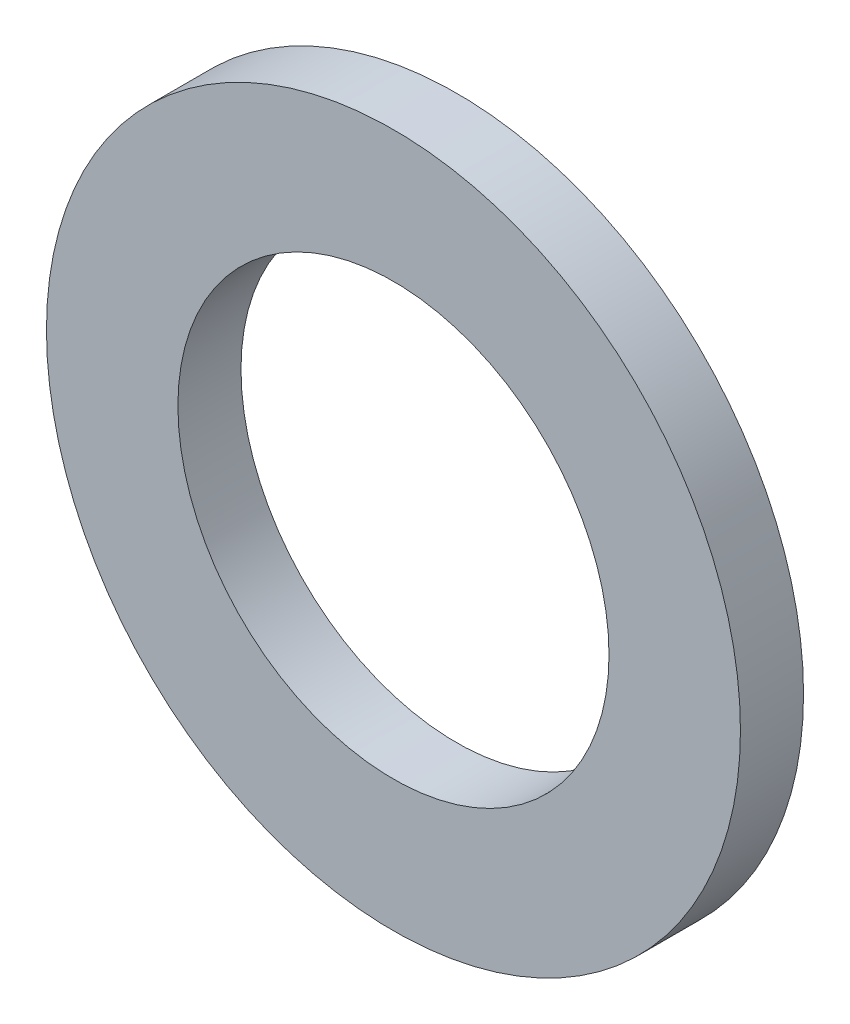
ISO-10303-21;
HEADER;
FILE_DESCRIPTION(('STEP AP214'),'2;1');
FILE_NAME('part.step','',(''),(''),'','','');
FILE_SCHEMA(('AUTOMOTIVE_DESIGN { 1 0 10303 214 1 1 1 1 }'));
ENDSEC;
DATA;
#1=APPLICATION_CONTEXT('core data for automotive mechanical design processes');
#2=APPLICATION_PROTOCOL_DEFINITION('international standard','automotive_design',2000,#1);
#3=PRODUCT_CONTEXT('',#1,'mechanical');
#4=PRODUCT('Part','Part','',(#3));
#5=PRODUCT_RELATED_PRODUCT_CATEGORY('part','',(#4));
#6=PRODUCT_DEFINITION_FORMATION('','',#4);
#7=PRODUCT_DEFINITION_CONTEXT('part definition',#1,'design');
#8=PRODUCT_DEFINITION('design','',#6,#7);
#9=PRODUCT_DEFINITION_SHAPE('','',#8);
#10=(LENGTH_UNIT() NAMED_UNIT(*) SI_UNIT(.MILLI.,.METRE.));
#11=(NAMED_UNIT(*) PLANE_ANGLE_UNIT() SI_UNIT($,.RADIAN.));
#12=(NAMED_UNIT(*) SI_UNIT($,.STERADIAN.) SOLID_ANGLE_UNIT());
#13=UNCERTAINTY_MEASURE_WITH_UNIT(LENGTH_MEASURE(1.E-05),#10,'distance_accuracy_value','');
#14=(GEOMETRIC_REPRESENTATION_CONTEXT(3) GLOBAL_UNCERTAINTY_ASSIGNED_CONTEXT((#13)) GLOBAL_UNIT_ASSIGNED_CONTEXT((#10,
#11,#12)) REPRESENTATION_CONTEXT('',''));
#15=CARTESIAN_POINT('',(0.,0.,0.));
#16=DIRECTION('',(0.,0.,1.));
#17=DIRECTION('',(1.,0.,0.));
#18=AXIS2_PLACEMENT_3D('',#15,#16,#17);
#19=CARTESIAN_POINT('',(0.,0.,1.2));
#20=DIRECTION('',(0.,0.,1.));
#21=DIRECTION('',(1.,0.,0.));
#22=AXIS2_PLACEMENT_3D('',#19,#20,#21);
#23=PLANE('',#22);
#24=CARTESIAN_POINT('',(0.,0.,1.2));
#25=DIRECTION('',(0.,0.,1.));
#26=DIRECTION('',(1.,0.,0.));
#27=AXIS2_PLACEMENT_3D('',#24,#25,#26);
#28=CIRCLE('',#27,6.6);
#29=CARTESIAN_POINT('',(6.6,0.,1.2));
#30=VERTEX_POINT('',#29);
#31=EDGE_CURVE('E10',#30,#30,#28,.T.);
#32=ORIENTED_EDGE('',*,*,#31,.T.);
#33=EDGE_LOOP('',(#32));
#34=FACE_BOUND('',#33,.T.);
#35=CARTESIAN_POINT('',(0.,0.,1.2));
#36=DIRECTION('',(0.,0.,1.));
#37=DIRECTION('',(1.,0.,0.));
#38=AXIS2_PLACEMENT_3D('',#35,#36,#37);
#39=CIRCLE('',#38,4.1);
#40=CARTESIAN_POINT('',(4.1,0.,1.2));
#41=VERTEX_POINT('',#40);
#42=EDGE_CURVE('E40',#41,#41,#39,.T.);
#43=ORIENTED_EDGE('',*,*,#42,.F.);
#44=EDGE_LOOP('',(#43));
#45=FACE_BOUND('',#44,.T.);
#46=ADVANCED_FACE('F29',(#34,#45),#23,.T.);
#47=CARTESIAN_POINT('',(0.,0.,0.));
#48=DIRECTION('',(0.,0.,1.));
#49=DIRECTION('',(1.,0.,0.));
#50=AXIS2_PLACEMENT_3D('',#47,#48,#49);
#51=PLANE('',#50);
#52=CARTESIAN_POINT('',(0.,0.,0.));
#53=DIRECTION('',(0.,0.,1.));
#54=DIRECTION('',(1.,0.,0.));
#55=AXIS2_PLACEMENT_3D('',#52,#53,#54);
#56=CIRCLE('',#55,6.6);
#57=CARTESIAN_POINT('',(6.6,0.,0.));
#58=VERTEX_POINT('',#57);
#59=EDGE_CURVE('E33',#58,#58,#56,.T.);
#60=ORIENTED_EDGE('',*,*,#59,.F.);
#61=EDGE_LOOP('',(#60));
#62=FACE_BOUND('',#61,.T.);
#63=CARTESIAN_POINT('',(0.,0.,0.));
#64=DIRECTION('',(0.,0.,1.));
#65=DIRECTION('',(1.,0.,0.));
#66=AXIS2_PLACEMENT_3D('',#63,#64,#65);
#67=CIRCLE('',#66,4.1);
#68=CARTESIAN_POINT('',(4.1,0.,0.));
#69=VERTEX_POINT('',#68);
#70=EDGE_CURVE('E42',#69,#69,#67,.T.);
#71=ORIENTED_EDGE('',*,*,#70,.T.);
#72=EDGE_LOOP('',(#71));
#73=FACE_BOUND('',#72,.T.);
#74=ADVANCED_FACE('F52',(#62,#73),#51,.F.);
#75=CARTESIAN_POINT('',(0.,0.,1.2));
#76=DIRECTION('',(0.,0.,-1.));
#77=DIRECTION('',(-1.,0.,0.));
#78=AXIS2_PLACEMENT_3D('',#75,#76,#77);
#79=CYLINDRICAL_SURFACE('',#78,6.6);
#80=ORIENTED_EDGE('',*,*,#31,.F.);
#81=EDGE_LOOP('',(#80));
#82=FACE_BOUND('',#81,.T.);
#83=ORIENTED_EDGE('',*,*,#59,.T.);
#84=EDGE_LOOP('',(#83));
#85=FACE_BOUND('',#84,.T.);
#86=ADVANCED_FACE('F31',(#82,#85),#79,.T.);
#87=CARTESIAN_POINT('',(0.,0.,1.2));
#88=DIRECTION('',(0.,0.,-1.));
#89=DIRECTION('',(-1.,0.,0.));
#90=AXIS2_PLACEMENT_3D('',#87,#88,#89);
#91=CYLINDRICAL_SURFACE('',#90,4.1);
#92=ORIENTED_EDGE('',*,*,#42,.T.);
#93=EDGE_LOOP('',(#92));
#94=FACE_BOUND('',#93,.T.);
#95=ORIENTED_EDGE('',*,*,#70,.F.);
#96=EDGE_LOOP('',(#95));
#97=FACE_BOUND('',#96,.T.);
#98=ADVANCED_FACE('F48',(#94,#97),#91,.F.);
#99=CLOSED_SHELL('',(#46,#74,#86,#98));
#100=MANIFOLD_SOLID_BREP('B2',#99);
#101=ADVANCED_BREP_SHAPE_REPRESENTATION('',(#18,#100),#14);
#102=SHAPE_DEFINITION_REPRESENTATION(#9,#101);
ENDSEC;
END-ISO-10303-21;
